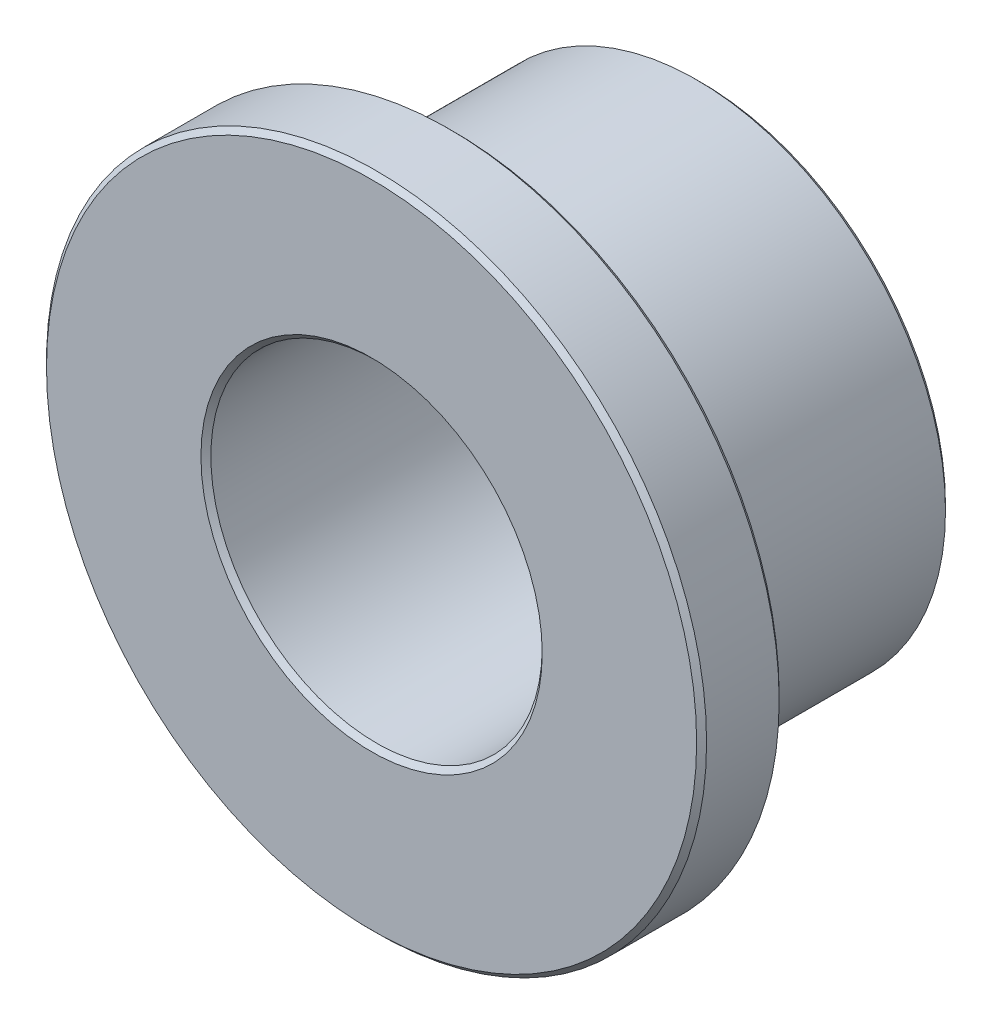
ISO-10303-21;
HEADER;
FILE_DESCRIPTION(('STEP AP214'),'2;1');
FILE_NAME('part.step','',(''),(''),'','','');
FILE_SCHEMA(('AUTOMOTIVE_DESIGN { 1 0 10303 214 1 1 1 1 }'));
ENDSEC;
DATA;
#1=APPLICATION_CONTEXT('core data for automotive mechanical design processes');
#2=APPLICATION_PROTOCOL_DEFINITION('international standard','automotive_design',2000,#1);
#3=PRODUCT_CONTEXT('',#1,'mechanical');
#4=PRODUCT('Part','Part','',(#3));
#5=PRODUCT_RELATED_PRODUCT_CATEGORY('part','',(#4));
#6=PRODUCT_DEFINITION_FORMATION('','',#4);
#7=PRODUCT_DEFINITION_CONTEXT('part definition',#1,'design');
#8=PRODUCT_DEFINITION('design','',#6,#7);
#9=PRODUCT_DEFINITION_SHAPE('','',#8);
#10=(LENGTH_UNIT() NAMED_UNIT(*) SI_UNIT(.MILLI.,.METRE.));
#11=(NAMED_UNIT(*) PLANE_ANGLE_UNIT() SI_UNIT($,.RADIAN.));
#12=(NAMED_UNIT(*) SI_UNIT($,.STERADIAN.) SOLID_ANGLE_UNIT());
#13=UNCERTAINTY_MEASURE_WITH_UNIT(LENGTH_MEASURE(1.E-05),#10,'distance_accuracy_value','');
#14=(GEOMETRIC_REPRESENTATION_CONTEXT(3) GLOBAL_UNCERTAINTY_ASSIGNED_CONTEXT((#13)) GLOBAL_UNIT_ASSIGNED_CONTEXT((#10,
#11,#12)) REPRESENTATION_CONTEXT('',''));
#15=CARTESIAN_POINT('',(0.,0.,0.));
#16=DIRECTION('',(0.,0.,1.));
#17=DIRECTION('',(1.,0.,0.));
#18=AXIS2_PLACEMENT_3D('',#15,#16,#17);
#19=CARTESIAN_POINT('',(0.,0.,1.5875));
#20=DIRECTION('',(0.,0.,1.));
#21=DIRECTION('',(1.,0.,0.));
#22=AXIS2_PLACEMENT_3D('',#19,#20,#21);
#23=CYLINDRICAL_SURFACE('',#22,6.35);
#24=CARTESIAN_POINT('',(0.,0.,3.079369));
#25=DIRECTION('',(0.,0.,1.));
#26=DIRECTION('',(1.,0.,0.));
#27=AXIS2_PLACEMENT_3D('',#24,#25,#26);
#28=CIRCLE('',#27,6.35);
#29=CARTESIAN_POINT('',(6.35,0.,3.079369));
#30=VERTEX_POINT('',#29);
#31=EDGE_CURVE('E61',#30,#30,#28,.F.);
#32=ORIENTED_EDGE('',*,*,#31,.T.);
#33=EDGE_LOOP('',(#32));
#34=FACE_BOUND('',#33,.T.);
#35=CARTESIAN_POINT('',(0.,0.,1.683131));
#36=DIRECTION('',(0.,0.,1.));
#37=DIRECTION('',(1.,0.,0.));
#38=AXIS2_PLACEMENT_3D('',#35,#36,#37);
#39=CIRCLE('',#38,6.35);
#40=CARTESIAN_POINT('',(6.35,0.,1.683131));
#41=VERTEX_POINT('',#40);
#42=EDGE_CURVE('E64',#41,#41,#39,.T.);
#43=ORIENTED_EDGE('',*,*,#42,.T.);
#44=EDGE_LOOP('',(#43));
#45=FACE_BOUND('',#44,.T.);
#46=ADVANCED_FACE('F35',(#34,#45),#23,.T.);
#47=CARTESIAN_POINT('',(0.,0.,1.5875));
#48=DIRECTION('',(0.,0.,1.));
#49=DIRECTION('',(1.,0.,0.));
#50=AXIS2_PLACEMENT_3D('',#47,#48,#49);
#51=PLANE('',#50);
#52=CARTESIAN_POINT('',(0.,0.,1.5875));
#53=DIRECTION('',(0.,0.,1.));
#54=DIRECTION('',(1.,0.,0.));
#55=AXIS2_PLACEMENT_3D('',#52,#53,#54);
#56=CIRCLE('',#55,6.254369);
#57=CARTESIAN_POINT('',(6.254369,0.,1.5875));
#58=VERTEX_POINT('',#57);
#59=EDGE_CURVE('E55',#58,#58,#56,.F.);
#60=ORIENTED_EDGE('',*,*,#59,.T.);
#61=EDGE_LOOP('',(#60));
#62=FACE_BOUND('',#61,.T.);
#63=CARTESIAN_POINT('',(0.,0.,1.5875));
#64=DIRECTION('',(0.,0.,1.));
#65=DIRECTION('',(1.,0.,0.));
#66=AXIS2_PLACEMENT_3D('',#63,#64,#65);
#67=CIRCLE('',#66,4.88353099999999);
#68=CARTESIAN_POINT('',(4.88353099999999,0.,1.5875));
#69=VERTEX_POINT('',#68);
#70=EDGE_CURVE('E58',#69,#69,#67,.T.);
#71=ORIENTED_EDGE('',*,*,#70,.T.);
#72=EDGE_LOOP('',(#71));
#73=FACE_BOUND('',#72,.T.);
#74=ADVANCED_FACE('F95',(#62,#73),#51,.F.);
#75=CARTESIAN_POINT('',(0.,0.,3.175));
#76=DIRECTION('',(0.,0.,1.));
#77=DIRECTION('',(1.,0.,0.));
#78=AXIS2_PLACEMENT_3D('',#75,#76,#77);
#79=PLANE('',#78);
#80=CARTESIAN_POINT('',(0.,0.,3.175));
#81=DIRECTION('',(0.,0.,1.));
#82=DIRECTION('',(1.,0.,0.));
#83=AXIS2_PLACEMENT_3D('',#80,#81,#82);
#84=CIRCLE('',#83,3.283331);
#85=CARTESIAN_POINT('',(3.283331,0.,3.175));
#86=VERTEX_POINT('',#85);
#87=EDGE_CURVE('E67',#86,#86,#84,.F.);
#88=ORIENTED_EDGE('',*,*,#87,.T.);
#89=EDGE_LOOP('',(#88));
#90=FACE_BOUND('',#89,.T.);
#91=CARTESIAN_POINT('',(0.,0.,3.175));
#92=DIRECTION('',(0.,0.,1.));
#93=DIRECTION('',(1.,0.,0.));
#94=AXIS2_PLACEMENT_3D('',#91,#92,#93);
#95=CIRCLE('',#94,6.254369);
#96=CARTESIAN_POINT('',(6.254369,0.,3.175));
#97=VERTEX_POINT('',#96);
#98=EDGE_CURVE('E70',#97,#97,#95,.T.);
#99=ORIENTED_EDGE('',*,*,#98,.T.);
#100=EDGE_LOOP('',(#99));
#101=FACE_BOUND('',#100,.T.);
#102=ADVANCED_FACE('F101',(#90,#101),#79,.T.);
#103=CARTESIAN_POINT('',(0.,0.,1.5875));
#104=DIRECTION('',(0.,0.,1.));
#105=DIRECTION('',(1.,0.,0.));
#106=AXIS2_PLACEMENT_3D('',#103,#104,#105);
#107=CYLINDRICAL_SURFACE('',#106,3.1877);
#108=CARTESIAN_POINT('',(0.,0.,3.079369));
#109=DIRECTION('',(0.,0.,1.));
#110=DIRECTION('',(1.,0.,0.));
#111=AXIS2_PLACEMENT_3D('',#108,#109,#110);
#112=CIRCLE('',#111,3.1877);
#113=CARTESIAN_POINT('',(3.1877,0.,3.079369));
#114=VERTEX_POINT('',#113);
#115=EDGE_CURVE('E73',#114,#114,#112,.T.);
#116=ORIENTED_EDGE('',*,*,#115,.T.);
#117=EDGE_LOOP('',(#116));
#118=FACE_BOUND('',#117,.T.);
#119=CARTESIAN_POINT('',(0.,0.,-3.079369));
#120=DIRECTION('',(0.,0.,1.));
#121=DIRECTION('',(1.,0.,0.));
#122=AXIS2_PLACEMENT_3D('',#119,#120,#121);
#123=CIRCLE('',#122,3.1877);
#124=CARTESIAN_POINT('',(3.1877,0.,-3.079369));
#125=VERTEX_POINT('',#124);
#126=EDGE_CURVE('E76',#125,#125,#123,.F.);
#127=ORIENTED_EDGE('',*,*,#126,.T.);
#128=EDGE_LOOP('',(#127));
#129=FACE_BOUND('',#128,.T.);
#130=ADVANCED_FACE('F80',(#118,#129),#107,.F.);
#131=CARTESIAN_POINT('',(0.,0.,-3.175));
#132=DIRECTION('',(0.,0.,1.));
#133=DIRECTION('',(1.,0.,0.));
#134=AXIS2_PLACEMENT_3D('',#131,#132,#133);
#135=CYLINDRICAL_SURFACE('',#134,4.7879);
#136=CARTESIAN_POINT('',(0.,0.,1.491869));
#137=DIRECTION('',(0.,0.,1.));
#138=DIRECTION('',(1.,0.,0.));
#139=AXIS2_PLACEMENT_3D('',#136,#137,#138);
#140=CIRCLE('',#139,4.7879);
#141=CARTESIAN_POINT('',(4.7879,0.,1.491869));
#142=VERTEX_POINT('',#141);
#143=EDGE_CURVE('E46',#142,#142,#140,.F.);
#144=CARTESIAN_POINT('',(0.,0.,-3.07936899999999));
#145=DIRECTION('',(0.,0.,1.));
#146=DIRECTION('',(1.,0.,0.));
#147=AXIS2_PLACEMENT_3D('',#144,#145,#146);
#148=CIRCLE('',#147,4.7879);
#149=CARTESIAN_POINT('',(4.7879,0.,-3.07936899999999));
#150=VERTEX_POINT('',#149);
#151=EDGE_CURVE('E50',#150,#150,#148,.T.);
#152=CARTESIAN_POINT('',(4.7879,0.,1.491869));
#153=CARTESIAN_POINT('',(4.7879,0.,1.4442519375));
#154=CARTESIAN_POINT('',(4.7879,0.,1.396634875));
#155=CARTESIAN_POINT('',(4.7879,0.,1.30140075));
#156=CARTESIAN_POINT('',(4.7879,0.,1.2537836875));
#157=CARTESIAN_POINT('',(4.7879,0.,1.1585495625));
#158=CARTESIAN_POINT('',(4.7879,0.,1.1109325));
#159=CARTESIAN_POINT('',(4.7879,0.,1.015698375));
#160=CARTESIAN_POINT('',(4.7879,0.,0.968081312500005));
#161=CARTESIAN_POINT('',(4.7879,0.,0.872847187500004));
#162=CARTESIAN_POINT('',(4.7879,0.,0.825230125000004));
#163=CARTESIAN_POINT('',(4.7879,0.,0.729996000000004));
#164=CARTESIAN_POINT('',(4.7879,0.,0.682378937500005));
#165=CARTESIAN_POINT('',(4.7879,0.,0.587144812500005));
#166=CARTESIAN_POINT('',(4.7879,0.,0.539527750000005));
#167=CARTESIAN_POINT('',(4.7879,0.,0.444293625000005));
#168=CARTESIAN_POINT('',(4.7879,0.,0.396676562500005));
#169=CARTESIAN_POINT('',(4.7879,0.,0.301442437500005));
#170=CARTESIAN_POINT('',(4.7879,0.,0.253825375000005));
#171=CARTESIAN_POINT('',(4.7879,0.,0.158591250000005));
#172=CARTESIAN_POINT('',(4.7879,0.,0.110974187500005));
#173=CARTESIAN_POINT('',(4.7879,0.,0.0157400625000052));
#174=CARTESIAN_POINT('',(4.7879,0.,-0.0318769999999947));
#175=CARTESIAN_POINT('',(4.7879,0.,-0.127111124999995));
#176=CARTESIAN_POINT('',(4.7879,0.,-0.174728187499995));
#177=CARTESIAN_POINT('',(4.7879,0.,-0.269962312499995));
#178=CARTESIAN_POINT('',(4.7879,0.,-0.317579374999995));
#179=CARTESIAN_POINT('',(4.7879,0.,-0.412813499999995));
#180=CARTESIAN_POINT('',(4.7879,0.,-0.460430562499995));
#181=CARTESIAN_POINT('',(4.7879,0.,-0.555664687499995));
#182=CARTESIAN_POINT('',(4.7879,0.,-0.603281749999995));
#183=CARTESIAN_POINT('',(4.7879,0.,-0.698515874999994));
#184=CARTESIAN_POINT('',(4.7879,0.,-0.746132937499994));
#185=CARTESIAN_POINT('',(4.7879,0.,-0.841367062499995));
#186=CARTESIAN_POINT('',(4.7879,0.,-0.888984124999995));
#187=CARTESIAN_POINT('',(4.7879,0.,-0.984218249999995));
#188=CARTESIAN_POINT('',(4.7879,0.,-1.03183531249999));
#189=CARTESIAN_POINT('',(4.7879,0.,-1.12706943749999));
#190=CARTESIAN_POINT('',(4.7879,0.,-1.17468649999999));
#191=CARTESIAN_POINT('',(4.7879,0.,-1.26992062499999));
#192=CARTESIAN_POINT('',(4.7879,0.,-1.31753768749999));
#193=CARTESIAN_POINT('',(4.7879,0.,-1.41277181249999));
#194=CARTESIAN_POINT('',(4.7879,0.,-1.46038887499999));
#195=CARTESIAN_POINT('',(4.7879,0.,-1.55562299999999));
#196=CARTESIAN_POINT('',(4.7879,0.,-1.60324006249999));
#197=CARTESIAN_POINT('',(4.7879,0.,-1.69847418749999));
#198=CARTESIAN_POINT('',(4.7879,0.,-1.74609124999999));
#199=CARTESIAN_POINT('',(4.7879,0.,-1.84132537499999));
#200=CARTESIAN_POINT('',(4.7879,0.,-1.88894243749999));
#201=CARTESIAN_POINT('',(4.7879,0.,-1.98417656249999));
#202=CARTESIAN_POINT('',(4.7879,0.,-2.03179362499999));
#203=CARTESIAN_POINT('',(4.7879,0.,-2.12702774999999));
#204=CARTESIAN_POINT('',(4.7879,0.,-2.17464481249999));
#205=CARTESIAN_POINT('',(4.7879,0.,-2.26987893749999));
#206=CARTESIAN_POINT('',(4.7879,0.,-2.31749599999999));
#207=CARTESIAN_POINT('',(4.7879,0.,-2.41273012499999));
#208=CARTESIAN_POINT('',(4.7879,0.,-2.46034718749999));
#209=CARTESIAN_POINT('',(4.7879,0.,-2.55558131249999));
#210=CARTESIAN_POINT('',(4.7879,0.,-2.60319837499999));
#211=CARTESIAN_POINT('',(4.7879,0.,-2.69843249999999));
#212=CARTESIAN_POINT('',(4.7879,0.,-2.74604956249999));
#213=CARTESIAN_POINT('',(4.7879,0.,-2.84128368749999));
#214=CARTESIAN_POINT('',(4.7879,0.,-2.88890074999999));
#215=CARTESIAN_POINT('',(4.7879,0.,-2.98413487499999));
#216=CARTESIAN_POINT('',(4.7879,0.,-3.03175193749999));
#217=CARTESIAN_POINT('',(4.7879,0.,-3.07936899999999));
#218=B_SPLINE_CURVE_WITH_KNOTS('',3,(#152,#153,#154,#155,#156,#157,#158,#159,#160,#161,#162,
#163,#164,#165,#166,#167,#168,#169,#170,#171,#172,#173,#174,#175,#176,#177,#178,#179,#180,#181,
#182,#183,#184,#185,#186,#187,#188,#189,#190,#191,#192,#193,#194,#195,#196,#197,#198,#199,#200,
#201,#202,#203,#204,#205,#206,#207,#208,#209,#210,#211,#212,#213,#214,#215,#216,#217),
.UNSPECIFIED.,.F.,.F.,(4,2,2,2,2,2,2,2,2,2,2,2,2,2,2,2,2,2,2,2,2,2,2,2,2,2,2,2,2,2,2,2,4),(0.,
0.1428511875,0.285702375,0.4285535625,0.57140475,0.7142559375,0.857107124999999,
0.999958312499999,1.1428095,1.2856606875,1.428511875,1.5713630625,1.71421425,1.8570654375,
1.999916625,2.1427678125,2.285619,2.4284701875,2.571321375,2.7141725625,2.85702375,2.9998749375,
3.142726125,3.2855773125,3.4284285,3.5712796875,3.714130875,3.8569820625,3.99983325,
4.1426844375,4.285535625,4.4283868125,4.571238),.UNSPECIFIED.);
#219=EDGE_CURVE('BSEAM150',#142,#150,#218,.T.);
#220=ORIENTED_EDGE('',*,*,#143,.T.);
#221=ORIENTED_EDGE('',*,*,#151,.T.);
#222=ORIENTED_EDGE('',*,*,#219,.T.);
#223=ORIENTED_EDGE('',*,*,#219,.F.);
#224=EDGE_LOOP('',(#220,#222,#221,#223));
#225=FACE_BOUND('',#224,.T.);
#226=ADVANCED_FACE('F150',(#225),#135,.T.);
#227=CARTESIAN_POINT('',(0.,0.,-3.175));
#228=DIRECTION('',(0.,0.,1.));
#229=DIRECTION('',(1.,0.,0.));
#230=AXIS2_PLACEMENT_3D('',#227,#228,#229);
#231=PLANE('',#230);
#232=CARTESIAN_POINT('',(0.,0.,-3.175));
#233=DIRECTION('',(0.,0.,1.));
#234=DIRECTION('',(1.,0.,0.));
#235=AXIS2_PLACEMENT_3D('',#232,#233,#234);
#236=CIRCLE('',#235,3.283331);
#237=CARTESIAN_POINT('',(3.283331,0.,-3.175));
#238=VERTEX_POINT('',#237);
#239=EDGE_CURVE('E10',#238,#238,#236,.T.);
#240=ORIENTED_EDGE('',*,*,#239,.T.);
#241=EDGE_LOOP('',(#240));
#242=FACE_BOUND('',#241,.T.);
#243=CARTESIAN_POINT('',(0.,0.,-3.175));
#244=DIRECTION('',(0.,0.,1.));
#245=DIRECTION('',(1.,0.,0.));
#246=AXIS2_PLACEMENT_3D('',#243,#244,#245);
#247=CIRCLE('',#246,4.69226899999999);
#248=CARTESIAN_POINT('',(4.69226899999999,0.,-3.175));
#249=VERTEX_POINT('',#248);
#250=EDGE_CURVE('E42',#249,#249,#247,.F.);
#251=ORIENTED_EDGE('',*,*,#250,.T.);
#252=EDGE_LOOP('',(#251));
#253=FACE_BOUND('',#252,.T.);
#254=ADVANCED_FACE('F111',(#242,#253),#231,.F.);
#255=CARTESIAN_POINT('',(0.,0.,3.079369));
#256=DIRECTION('',(0.,0.,1.));
#257=DIRECTION('',(1.,0.,0.));
#258=AXIS2_PLACEMENT_3D('',#255,#256,#257);
#259=CONICAL_SURFACE('',#258,3.1877,0.785398163397444);
#260=ORIENTED_EDGE('',*,*,#87,.F.);
#261=EDGE_LOOP('',(#260));
#262=FACE_BOUND('',#261,.T.);
#263=ORIENTED_EDGE('',*,*,#115,.F.);
#264=EDGE_LOOP('',(#263));
#265=FACE_BOUND('',#264,.T.);
#266=ADVANCED_FACE('F107',(#262,#265),#259,.F.);
#267=CARTESIAN_POINT('',(0.,0.,3.175));
#268=DIRECTION('',(0.,0.,-1.));
#269=DIRECTION('',(-1.,0.,0.));
#270=AXIS2_PLACEMENT_3D('',#267,#268,#269);
#271=CONICAL_SURFACE('',#270,6.254369,0.785398163397444);
#272=ORIENTED_EDGE('',*,*,#31,.F.);
#273=EDGE_LOOP('',(#272));
#274=FACE_BOUND('',#273,.T.);
#275=ORIENTED_EDGE('',*,*,#98,.F.);
#276=EDGE_LOOP('',(#275));
#277=FACE_BOUND('',#276,.T.);
#278=ADVANCED_FACE('F110',(#274,#277),#271,.T.);
#279=CARTESIAN_POINT('',(0.,0.,1.683131));
#280=DIRECTION('',(0.,0.,1.));
#281=DIRECTION('',(1.,0.,0.));
#282=AXIS2_PLACEMENT_3D('',#279,#280,#281);
#283=CONICAL_SURFACE('',#282,6.35,0.785398163397448);
#284=ORIENTED_EDGE('',*,*,#59,.F.);
#285=EDGE_LOOP('',(#284));
#286=FACE_BOUND('',#285,.T.);
#287=ORIENTED_EDGE('',*,*,#42,.F.);
#288=EDGE_LOOP('',(#287));
#289=FACE_BOUND('',#288,.T.);
#290=ADVANCED_FACE('F91',(#286,#289),#283,.T.);
#291=CARTESIAN_POINT('',(0.,0.,1.5875));
#292=DIRECTION('',(0.,0.,1.));
#293=DIRECTION('',(1.,0.,0.));
#294=AXIS2_PLACEMENT_3D('',#291,#292,#293);
#295=CONICAL_SURFACE('',#294,4.88353099999999,0.785398163397453);
#296=ORIENTED_EDGE('',*,*,#143,.F.);
#297=EDGE_LOOP('',(#296));
#298=FACE_BOUND('',#297,.T.);
#299=ORIENTED_EDGE('',*,*,#70,.F.);
#300=EDGE_LOOP('',(#299));
#301=FACE_BOUND('',#300,.T.);
#302=ADVANCED_FACE('F85',(#298,#301),#295,.T.);
#303=CARTESIAN_POINT('',(0.,0.,-3.175));
#304=DIRECTION('',(0.,0.,-1.));
#305=DIRECTION('',(-1.,0.,0.));
#306=AXIS2_PLACEMENT_3D('',#303,#304,#305);
#307=CONICAL_SURFACE('',#306,3.283331,0.785398163397444);
#308=ORIENTED_EDGE('',*,*,#126,.F.);
#309=EDGE_LOOP('',(#308));
#310=FACE_BOUND('',#309,.T.);
#311=ORIENTED_EDGE('',*,*,#239,.F.);
#312=EDGE_LOOP('',(#311));
#313=FACE_BOUND('',#312,.T.);
#314=ADVANCED_FACE('F82',(#310,#313),#307,.F.);
#315=CARTESIAN_POINT('',(0.,0.,-3.07936899999999));
#316=DIRECTION('',(0.,0.,1.));
#317=DIRECTION('',(1.,0.,0.));
#318=AXIS2_PLACEMENT_3D('',#315,#316,#317);
#319=CONICAL_SURFACE('',#318,4.7879,0.785398163397444);
#320=ORIENTED_EDGE('',*,*,#250,.F.);
#321=EDGE_LOOP('',(#320));
#322=FACE_BOUND('',#321,.T.);
#323=ORIENTED_EDGE('',*,*,#151,.F.);
#324=EDGE_LOOP('',(#323));
#325=FACE_BOUND('',#324,.T.);
#326=ADVANCED_FACE('F37',(#322,#325),#319,.T.);
#327=CLOSED_SHELL('',(#46,#74,#102,#130,#226,#254,#266,#278,#290,#302,#314,#326));
#328=MANIFOLD_SOLID_BREP('B2',#327);
#329=ADVANCED_BREP_SHAPE_REPRESENTATION('',(#18,#328),#14);
#330=SHAPE_DEFINITION_REPRESENTATION(#9,#329);
ENDSEC;
END-ISO-10303-21;
